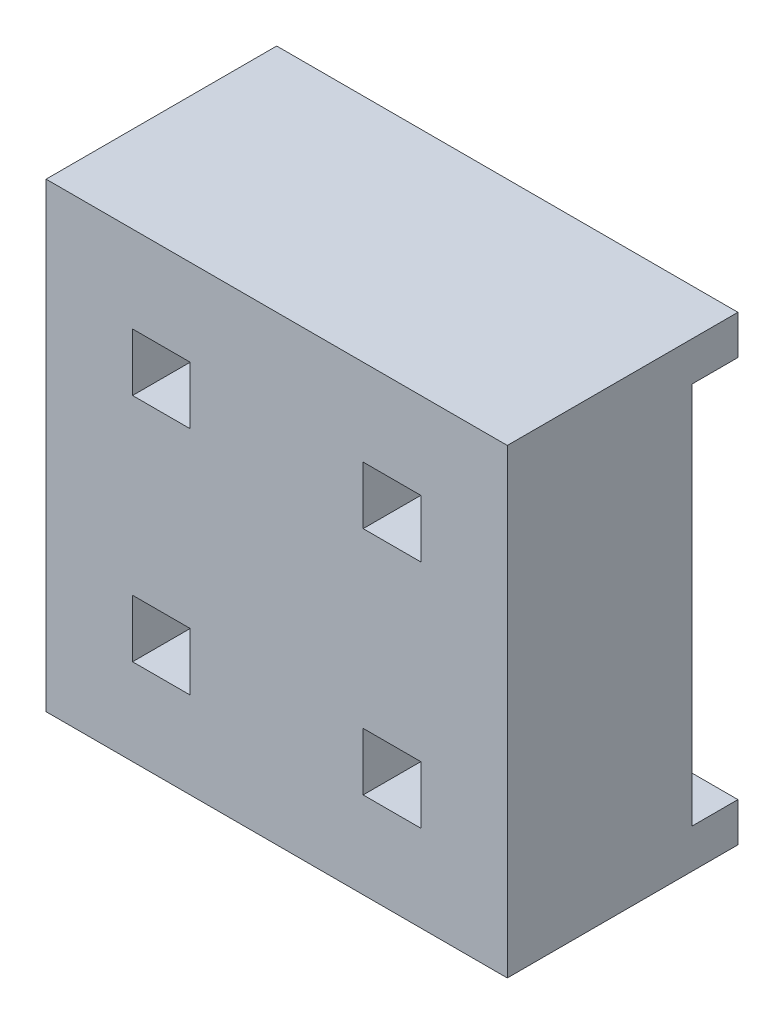
ISO-10303-21;
HEADER;
FILE_DESCRIPTION(('STEP AP214'),'2;1');
FILE_NAME('part.step','',(''),(''),'','','');
FILE_SCHEMA(('AUTOMOTIVE_DESIGN { 1 0 10303 214 1 1 1 1 }'));
ENDSEC;
DATA;
#1=APPLICATION_CONTEXT('core data for automotive mechanical design processes');
#2=APPLICATION_PROTOCOL_DEFINITION('international standard','automotive_design',2000,#1);
#3=PRODUCT_CONTEXT('',#1,'mechanical');
#4=PRODUCT('Part','Part','',(#3));
#5=PRODUCT_RELATED_PRODUCT_CATEGORY('part','',(#4));
#6=PRODUCT_DEFINITION_FORMATION('','',#4);
#7=PRODUCT_DEFINITION_CONTEXT('part definition',#1,'design');
#8=PRODUCT_DEFINITION('design','',#6,#7);
#9=PRODUCT_DEFINITION_SHAPE('','',#8);
#10=(LENGTH_UNIT() NAMED_UNIT(*) SI_UNIT(.MILLI.,.METRE.));
#11=(NAMED_UNIT(*) PLANE_ANGLE_UNIT() SI_UNIT($,.RADIAN.));
#12=(NAMED_UNIT(*) SI_UNIT($,.STERADIAN.) SOLID_ANGLE_UNIT());
#13=UNCERTAINTY_MEASURE_WITH_UNIT(LENGTH_MEASURE(1.E-05),#10,'distance_accuracy_value','');
#14=(GEOMETRIC_REPRESENTATION_CONTEXT(3) GLOBAL_UNCERTAINTY_ASSIGNED_CONTEXT((#13)) GLOBAL_UNIT_ASSIGNED_CONTEXT((#10,
#11,#12)) REPRESENTATION_CONTEXT('',''));
#15=CARTESIAN_POINT('',(0.,0.,0.));
#16=DIRECTION('',(0.,0.,1.));
#17=DIRECTION('',(1.,0.,0.));
#18=AXIS2_PLACEMENT_3D('',#15,#16,#17);
#19=CARTESIAN_POINT('',(0.000124023441458121,9.92187488009222E-05,1.25));
#20=DIRECTION('',(0.,-4.37113882867379E-08,1.));
#21=DIRECTION('',(0.,-1.,-4.37113882867379E-08));
#22=AXIS2_PLACEMENT_3D('',#19,#20,#21);
#23=PLANE('',#22);
#24=DIRECTION('',(0.,-0.999999999999999,-4.37113882735736E-08));
#25=VECTOR('',#24,1.);
#26=CARTESIAN_POINT('',(-2.53987597655854,-2.1081007812512,1.24999990784765));
#27=LINE('',#26,#25);
#28=CARTESIAN_POINT('',(-2.53987597655854,-2.1081007812512,1.24999990784765));
#29=VERTEX_POINT('',#28);
#30=CARTESIAN_POINT('',(-2.53987597655854,-2.5399007812512,1.24999988897307));
#31=VERTEX_POINT('',#30);
#32=EDGE_CURVE('E11',#29,#31,#27,.T.);
#33=ORIENTED_EDGE('',*,*,#32,.F.);
#34=DIRECTION('',(1.,0.,0.));
#35=VECTOR('',#34,1.);
#36=CARTESIAN_POINT('',(-2.53987597655854,-2.1081007812512,1.24999990784765));
#37=LINE('',#36,#35);
#38=CARTESIAN_POINT('',(2.54012402344146,-2.1081007812512,1.24999990784765));
#39=VERTEX_POINT('',#38);
#40=EDGE_CURVE('E323',#29,#39,#37,.T.);
#41=ORIENTED_EDGE('',*,*,#40,.T.);
#42=DIRECTION('',(0.,0.999999999999999,4.37113882735736E-08));
#43=VECTOR('',#42,1.);
#44=CARTESIAN_POINT('',(2.54012402344146,-2.5399007812512,1.24999988897307));
#45=LINE('',#44,#43);
#46=CARTESIAN_POINT('',(2.54012402344146,-2.5399007812512,1.24999988897307));
#47=VERTEX_POINT('',#46);
#48=EDGE_CURVE('E316',#47,#39,#45,.T.);
#49=ORIENTED_EDGE('',*,*,#48,.F.);
#50=DIRECTION('',(1.,0.,0.));
#51=VECTOR('',#50,1.);
#52=CARTESIAN_POINT('',(-2.53987597655854,-2.5399007812512,1.24999988897307));
#53=LINE('',#52,#51);
#54=EDGE_CURVE('E321',#31,#47,#53,.T.);
#55=ORIENTED_EDGE('',*,*,#54,.F.);
#56=EDGE_LOOP('',(#33,#41,#49,#55));
#57=FACE_BOUND('',#56,.T.);
#58=ADVANCED_FACE('F17',(#57),#23,.F.);
#59=CARTESIAN_POINT('',(-2.53987597655854,2.54009910772187,3.79000011102693));
#60=DIRECTION('',(1.,0.,0.));
#61=DIRECTION('',(0.,1.,4.37113882867379E-08));
#62=AXIS2_PLACEMENT_3D('',#59,#60,#61);
#63=PLANE('',#62);
#64=DIRECTION('',(0.,-0.999999999999999,-4.37113883231379E-08));
#65=VECTOR('',#64,1.);
#66=CARTESIAN_POINT('',(-2.53987597655854,2.10829919654342,1.75800009215235));
#67=LINE('',#66,#65);
#68=CARTESIAN_POINT('',(-2.53987597655854,2.10829919654342,1.75800009215235));
#69=VERTEX_POINT('',#68);
#70=CARTESIAN_POINT('',(-2.53987597655854,-2.10810080345658,1.75799990784765));
#71=VERTEX_POINT('',#70);
#72=EDGE_CURVE('E24',#69,#71,#67,.T.);
#73=ORIENTED_EDGE('',*,*,#72,.T.);
#74=DIRECTION('',(0.,4.37113888392268E-08,-0.999999999999999));
#75=VECTOR('',#74,1.);
#76=CARTESIAN_POINT('',(-2.53987597655854,-2.10810080345658,1.75799990784765));
#77=LINE('',#76,#75);
#78=EDGE_CURVE('E319',#71,#29,#77,.T.);
#79=ORIENTED_EDGE('',*,*,#78,.T.);
#80=ORIENTED_EDGE('',*,*,#32,.T.);
#81=DIRECTION('',(0.,4.3711388314712E-08,-0.999999999999999));
#82=VECTOR('',#81,1.);
#83=CARTESIAN_POINT('',(-2.53987597655854,-2.53990089227813,3.78999988897307));
#84=LINE('',#83,#82);
#85=CARTESIAN_POINT('',(-2.53987597655854,-2.53990089227813,3.78999988897307));
#86=VERTEX_POINT('',#85);
#87=EDGE_CURVE('E301',#86,#31,#84,.T.);
#88=ORIENTED_EDGE('',*,*,#87,.F.);
#89=DIRECTION('',(0.,-0.999999999999999,-4.37113884895503E-08));
#90=VECTOR('',#89,1.);
#91=CARTESIAN_POINT('',(-2.53987597655854,2.54009910772187,3.79000011102693));
#92=LINE('',#91,#90);
#93=CARTESIAN_POINT('',(-2.53987597655854,2.54009910772187,3.79000011102693));
#94=VERTEX_POINT('',#93);
#95=EDGE_CURVE('E289',#94,#86,#92,.T.);
#96=ORIENTED_EDGE('',*,*,#95,.F.);
#97=DIRECTION('',(0.,4.3711388314712E-08,-0.999999999999999));
#98=VECTOR('',#97,1.);
#99=CARTESIAN_POINT('',(-2.53987597655854,2.54009910772187,3.79000011102693));
#100=LINE('',#99,#98);
#101=CARTESIAN_POINT('',(-2.53987597655854,2.5400992187488,1.25000011102693));
#102=VERTEX_POINT('',#101);
#103=EDGE_CURVE('E276',#94,#102,#100,.T.);
#104=ORIENTED_EDGE('',*,*,#103,.T.);
#105=DIRECTION('',(0.,-0.999999999999999,-4.37113882735736E-08));
#106=VECTOR('',#105,1.);
#107=CARTESIAN_POINT('',(-2.53987597655854,2.5400992187488,1.25000011102693));
#108=LINE('',#107,#106);
#109=CARTESIAN_POINT('',(-2.53987597655854,2.1082992187488,1.25000009215235));
#110=VERTEX_POINT('',#109);
#111=EDGE_CURVE('E261',#102,#110,#108,.T.);
#112=ORIENTED_EDGE('',*,*,#111,.T.);
#113=DIRECTION('',(0.,-4.37113879650355E-08,0.999999999999999));
#114=VECTOR('',#113,1.);
#115=CARTESIAN_POINT('',(-2.53987597655854,2.1082992187488,1.25000009215235));
#116=LINE('',#115,#114);
#117=EDGE_CURVE('E247',#110,#69,#116,.T.);
#118=ORIENTED_EDGE('',*,*,#117,.T.);
#119=EDGE_LOOP('',(#73,#79,#80,#88,#96,#104,#112,#118));
#120=FACE_BOUND('',#119,.T.);
#121=ADVANCED_FACE('F416',(#120),#63,.F.);
#122=CARTESIAN_POINT('',(-2.53987597655854,-2.53990089227813,3.78999988897307));
#123=DIRECTION('',(0.,1.,4.37113882867379E-08));
#124=DIRECTION('',(-1.,0.,0.));
#125=AXIS2_PLACEMENT_3D('',#122,#123,#124);
#126=PLANE('',#125);
#127=ORIENTED_EDGE('',*,*,#54,.T.);
#128=DIRECTION('',(0.,4.3711388314712E-08,-0.999999999999999));
#129=VECTOR('',#128,1.);
#130=CARTESIAN_POINT('',(2.54012402344146,-2.53990089227813,3.78999988897307));
#131=LINE('',#130,#129);
#132=CARTESIAN_POINT('',(2.54012402344146,-2.53990089227813,3.78999988897307));
#133=VERTEX_POINT('',#132);
#134=EDGE_CURVE('E313',#133,#47,#131,.T.);
#135=ORIENTED_EDGE('',*,*,#134,.F.);
#136=DIRECTION('',(1.,0.,0.));
#137=VECTOR('',#136,1.);
#138=CARTESIAN_POINT('',(-2.53987597655854,-2.53990089227813,3.78999988897307));
#139=LINE('',#138,#137);
#140=EDGE_CURVE('E304',#86,#133,#139,.T.);
#141=ORIENTED_EDGE('',*,*,#140,.F.);
#142=ORIENTED_EDGE('',*,*,#87,.T.);
#143=EDGE_LOOP('',(#127,#135,#141,#142));
#144=FACE_BOUND('',#143,.T.);
#145=ADVANCED_FACE('F420',(#144),#126,.F.);
#146=CARTESIAN_POINT('',(2.54012402344146,-2.53990089227813,3.78999988897307));
#147=DIRECTION('',(-1.,0.,0.));
#148=DIRECTION('',(0.,-1.,-4.37113882867379E-08));
#149=AXIS2_PLACEMENT_3D('',#146,#147,#148);
#150=PLANE('',#149);
#151=ORIENTED_EDGE('',*,*,#48,.T.);
#152=DIRECTION('',(0.,4.37113888392268E-08,-0.999999999999999));
#153=VECTOR('',#152,1.);
#154=CARTESIAN_POINT('',(2.54012402344146,-2.10810080345658,1.75799990784765));
#155=LINE('',#154,#153);
#156=CARTESIAN_POINT('',(2.54012402344146,-2.10810080345658,1.75799990784765));
#157=VERTEX_POINT('',#156);
#158=EDGE_CURVE('E307',#157,#39,#155,.T.);
#159=ORIENTED_EDGE('',*,*,#158,.F.);
#160=DIRECTION('',(0.,-0.999999999999999,-4.37113883231379E-08));
#161=VECTOR('',#160,1.);
#162=CARTESIAN_POINT('',(2.54012402344146,2.10829919654342,1.75800009215235));
#163=LINE('',#162,#161);
#164=CARTESIAN_POINT('',(2.54012402344146,2.10829919654342,1.75800009215235));
#165=VERTEX_POINT('',#164);
#166=EDGE_CURVE('E292',#165,#157,#163,.T.);
#167=ORIENTED_EDGE('',*,*,#166,.F.);
#168=DIRECTION('',(0.,-4.37113879650355E-08,0.999999999999999));
#169=VECTOR('',#168,1.);
#170=CARTESIAN_POINT('',(2.54012402344146,2.1082992187488,1.25000009215235));
#171=LINE('',#170,#169);
#172=CARTESIAN_POINT('',(2.54012402344146,2.1082992187488,1.25000009215235));
#173=VERTEX_POINT('',#172);
#174=EDGE_CURVE('E278',#173,#165,#171,.T.);
#175=ORIENTED_EDGE('',*,*,#174,.F.);
#176=DIRECTION('',(0.,0.999999999999999,4.37113882735736E-08));
#177=VECTOR('',#176,1.);
#178=CARTESIAN_POINT('',(2.54012402344146,2.1082992187488,1.25000009215235));
#179=LINE('',#178,#177);
#180=CARTESIAN_POINT('',(2.54012402344146,2.5400992187488,1.25000011102693));
#181=VERTEX_POINT('',#180);
#182=EDGE_CURVE('E263',#173,#181,#179,.T.);
#183=ORIENTED_EDGE('',*,*,#182,.T.);
#184=DIRECTION('',(0.,4.3711388314712E-08,-0.999999999999999));
#185=VECTOR('',#184,1.);
#186=CARTESIAN_POINT('',(2.54012402344146,2.54009910772187,3.79000011102693));
#187=LINE('',#186,#185);
#188=CARTESIAN_POINT('',(2.54012402344146,2.54009910772187,3.79000011102693));
#189=VERTEX_POINT('',#188);
#190=EDGE_CURVE('E249',#189,#181,#187,.T.);
#191=ORIENTED_EDGE('',*,*,#190,.F.);
#192=DIRECTION('',(0.,0.999999999999999,4.37113881398737E-08));
#193=VECTOR('',#192,1.);
#194=CARTESIAN_POINT('',(2.54012402344146,-2.53990089227813,3.78999988897307));
#195=LINE('',#194,#193);
#196=EDGE_CURVE('E236',#133,#189,#195,.T.);
#197=ORIENTED_EDGE('',*,*,#196,.F.);
#198=ORIENTED_EDGE('',*,*,#134,.T.);
#199=EDGE_LOOP('',(#151,#159,#167,#175,#183,#191,#197,#198));
#200=FACE_BOUND('',#199,.T.);
#201=ADVANCED_FACE('F329',(#200),#150,.F.);
#202=CARTESIAN_POINT('',(0.952624023441458,1.58759910772187,3.79000006939183));
#203=DIRECTION('',(1.,0.,0.));
#204=DIRECTION('',(0.,1.,4.37113882867379E-08));
#205=AXIS2_PLACEMENT_3D('',#202,#203,#204);
#206=PLANE('',#205);
#207=DIRECTION('',(0.,-0.999999999999999,-4.3711388314712E-08));
#208=VECTOR('',#207,1.);
#209=CARTESIAN_POINT('',(0.952624023441458,1.58759919654342,1.75800006939183));
#210=LINE('',#209,#208);
#211=CARTESIAN_POINT('',(0.952624023441458,1.58759919654342,1.75800006939183));
#212=VERTEX_POINT('',#211);
#213=CARTESIAN_POINT('',(0.952624023441458,0.952599196543416,1.7580000416351));
#214=VERTEX_POINT('',#213);
#215=EDGE_CURVE('E310',#212,#214,#210,.T.);
#216=ORIENTED_EDGE('',*,*,#215,.F.);
#217=DIRECTION('',(0.,4.37113884021311E-08,-0.999999999999999));
#218=VECTOR('',#217,1.);
#219=CARTESIAN_POINT('',(0.952624023441458,1.58759910772187,3.79000006939183));
#220=LINE('',#219,#218);
#221=CARTESIAN_POINT('',(0.952624023441458,1.58759910772187,3.79000006939183));
#222=VERTEX_POINT('',#221);
#223=EDGE_CURVE('E295',#222,#212,#220,.T.);
#224=ORIENTED_EDGE('',*,*,#223,.F.);
#225=DIRECTION('',(0.,-0.999999999999999,-4.3711388314712E-08));
#226=VECTOR('',#225,1.);
#227=CARTESIAN_POINT('',(0.952624023441458,1.58759910772187,3.79000006939183));
#228=LINE('',#227,#226);
#229=CARTESIAN_POINT('',(0.952624023441458,0.952599107721875,3.7900000416351));
#230=VERTEX_POINT('',#229);
#231=EDGE_CURVE('E281',#222,#230,#228,.T.);
#232=ORIENTED_EDGE('',*,*,#231,.T.);
#233=DIRECTION('',(0.,4.37113882928572E-08,-0.999999999999999));
#234=VECTOR('',#233,1.);
#235=CARTESIAN_POINT('',(0.952624023441458,0.952599107721875,3.7900000416351));
#236=LINE('',#235,#234);
#237=EDGE_CURVE('E265',#230,#214,#236,.T.);
#238=ORIENTED_EDGE('',*,*,#237,.T.);
#239=EDGE_LOOP('',(#216,#224,#232,#238));
#240=FACE_BOUND('',#239,.T.);
#241=ADVANCED_FACE('F435',(#240),#206,.T.);
#242=CARTESIAN_POINT('',(1.58762402344146,1.58759910772187,3.79000006939183));
#243=DIRECTION('',(0.,-1.,-4.37113882867379E-08));
#244=DIRECTION('',(1.,0.,0.));
#245=AXIS2_PLACEMENT_3D('',#242,#243,#244);
#246=PLANE('',#245);
#247=DIRECTION('',(-1.,0.,0.));
#248=VECTOR('',#247,1.);
#249=CARTESIAN_POINT('',(1.58762402344146,1.58759919654342,1.75800006939183));
#250=LINE('',#249,#248);
#251=CARTESIAN_POINT('',(1.58762402344146,1.58759919654342,1.75800006939183));
#252=VERTEX_POINT('',#251);
#253=EDGE_CURVE('E298',#252,#212,#250,.T.);
#254=ORIENTED_EDGE('',*,*,#253,.F.);
#255=DIRECTION('',(0.,4.37113884021311E-08,-0.999999999999999));
#256=VECTOR('',#255,1.);
#257=CARTESIAN_POINT('',(1.58762402344146,1.58759910772187,3.79000006939183));
#258=LINE('',#257,#256);
#259=CARTESIAN_POINT('',(1.58762402344146,1.58759910772187,3.79000006939183));
#260=VERTEX_POINT('',#259);
#261=EDGE_CURVE('E283',#260,#252,#258,.T.);
#262=ORIENTED_EDGE('',*,*,#261,.F.);
#263=DIRECTION('',(-1.,0.,0.));
#264=VECTOR('',#263,1.);
#265=CARTESIAN_POINT('',(1.58762402344146,1.58759910772187,3.79000006939183));
#266=LINE('',#265,#264);
#267=EDGE_CURVE('E267',#260,#222,#266,.T.);
#268=ORIENTED_EDGE('',*,*,#267,.T.);
#269=ORIENTED_EDGE('',*,*,#223,.T.);
#270=EDGE_LOOP('',(#254,#262,#268,#269));
#271=FACE_BOUND('',#270,.T.);
#272=ADVANCED_FACE('F438',(#271),#246,.T.);
#273=CARTESIAN_POINT('',(1.58762402344146,0.952599107721875,3.7900000416351));
#274=DIRECTION('',(-1.,0.,0.));
#275=DIRECTION('',(0.,-1.,-4.37113882867379E-08));
#276=AXIS2_PLACEMENT_3D('',#273,#274,#275);
#277=PLANE('',#276);
#278=DIRECTION('',(0.,0.999999999999999,4.3711388314712E-08));
#279=VECTOR('',#278,1.);
#280=CARTESIAN_POINT('',(1.58762402344146,0.952599196543416,1.7580000416351));
#281=LINE('',#280,#279);
#282=CARTESIAN_POINT('',(1.58762402344146,0.952599196543416,1.7580000416351));
#283=VERTEX_POINT('',#282);
#284=EDGE_CURVE('E286',#283,#252,#281,.T.);
#285=ORIENTED_EDGE('',*,*,#284,.F.);
#286=DIRECTION('',(0.,4.37113882928572E-08,-0.999999999999999));
#287=VECTOR('',#286,1.);
#288=CARTESIAN_POINT('',(1.58762402344146,0.952599107721875,3.7900000416351));
#289=LINE('',#288,#287);
#290=CARTESIAN_POINT('',(1.58762402344146,0.952599107721875,3.7900000416351));
#291=VERTEX_POINT('',#290);
#292=EDGE_CURVE('E270',#291,#283,#289,.T.);
#293=ORIENTED_EDGE('',*,*,#292,.F.);
#294=DIRECTION('',(0.,0.999999999999999,4.3711388314712E-08));
#295=VECTOR('',#294,1.);
#296=CARTESIAN_POINT('',(1.58762402344146,0.952599107721875,3.7900000416351));
#297=LINE('',#296,#295);
#298=EDGE_CURVE('E252',#291,#260,#297,.T.);
#299=ORIENTED_EDGE('',*,*,#298,.T.);
#300=ORIENTED_EDGE('',*,*,#261,.T.);
#301=EDGE_LOOP('',(#285,#293,#299,#300));
#302=FACE_BOUND('',#301,.T.);
#303=ADVANCED_FACE('F442',(#302),#277,.T.);
#304=CARTESIAN_POINT('',(0.952624023441458,-0.952400892278125,3.7899999583649));
#305=DIRECTION('',(1.,0.,0.));
#306=DIRECTION('',(0.,1.,4.37113882867379E-08));
#307=AXIS2_PLACEMENT_3D('',#304,#305,#306);
#308=PLANE('',#307);
#309=DIRECTION('',(0.,-0.999999999999999,-4.3711388314712E-08));
#310=VECTOR('',#309,1.);
#311=CARTESIAN_POINT('',(0.952624023441458,-0.952400803456584,1.7579999583649));
#312=LINE('',#311,#310);
#313=CARTESIAN_POINT('',(0.952624023441458,-0.952400803456584,1.7579999583649));
#314=VERTEX_POINT('',#313);
#315=CARTESIAN_POINT('',(0.952624023441458,-1.58740080345658,1.75799993060817));
#316=VERTEX_POINT('',#315);
#317=EDGE_CURVE('E273',#314,#316,#312,.T.);
#318=ORIENTED_EDGE('',*,*,#317,.F.);
#319=DIRECTION('',(0.,4.37113882928572E-08,-0.999999999999999));
#320=VECTOR('',#319,1.);
#321=CARTESIAN_POINT('',(0.952624023441458,-0.952400892278125,3.7899999583649));
#322=LINE('',#321,#320);
#323=CARTESIAN_POINT('',(0.952624023441458,-0.952400892278125,3.7899999583649));
#324=VERTEX_POINT('',#323);
#325=EDGE_CURVE('E255',#324,#314,#322,.T.);
#326=ORIENTED_EDGE('',*,*,#325,.F.);
#327=DIRECTION('',(0.,-0.999999999999999,-4.3711388314712E-08));
#328=VECTOR('',#327,1.);
#329=CARTESIAN_POINT('',(0.952624023441458,-0.952400892278125,3.7899999583649));
#330=LINE('',#329,#328);
#331=CARTESIAN_POINT('',(0.952624023441458,-1.58740089227813,3.78999993060817));
#332=VERTEX_POINT('',#331);
#333=EDGE_CURVE('E239',#324,#332,#330,.T.);
#334=ORIENTED_EDGE('',*,*,#333,.T.);
#335=DIRECTION('',(0.,4.37113881835833E-08,-0.999999999999999));
#336=VECTOR('',#335,1.);
#337=CARTESIAN_POINT('',(0.952624023441458,-1.58740089227813,3.78999993060817));
#338=LINE('',#337,#336);
#339=EDGE_CURVE('E225',#332,#316,#338,.T.);
#340=ORIENTED_EDGE('',*,*,#339,.T.);
#341=EDGE_LOOP('',(#318,#326,#334,#340));
#342=FACE_BOUND('',#341,.T.);
#343=ADVANCED_FACE('F450',(#342),#308,.T.);
#344=CARTESIAN_POINT('',(1.58762402344146,-0.952400892278125,3.7899999583649));
#345=DIRECTION('',(0.,-1.,-4.37113882867379E-08));
#346=DIRECTION('',(1.,0.,0.));
#347=AXIS2_PLACEMENT_3D('',#344,#345,#346);
#348=PLANE('',#347);
#349=DIRECTION('',(-1.,0.,0.));
#350=VECTOR('',#349,1.);
#351=CARTESIAN_POINT('',(1.58762402344146,-0.952400803456584,1.7579999583649));
#352=LINE('',#351,#350);
#353=CARTESIAN_POINT('',(1.58762402344146,-0.952400803456584,1.7579999583649));
#354=VERTEX_POINT('',#353);
#355=EDGE_CURVE('E258',#354,#314,#352,.T.);
#356=ORIENTED_EDGE('',*,*,#355,.F.);
#357=DIRECTION('',(0.,4.37113882928572E-08,-0.999999999999999));
#358=VECTOR('',#357,1.);
#359=CARTESIAN_POINT('',(1.58762402344146,-0.952400892278125,3.7899999583649));
#360=LINE('',#359,#358);
#361=CARTESIAN_POINT('',(1.58762402344146,-0.952400892278125,3.7899999583649));
#362=VERTEX_POINT('',#361);
#363=EDGE_CURVE('E241',#362,#354,#360,.T.);
#364=ORIENTED_EDGE('',*,*,#363,.F.);
#365=DIRECTION('',(-1.,0.,0.));
#366=VECTOR('',#365,1.);
#367=CARTESIAN_POINT('',(1.58762402344146,-0.952400892278125,3.7899999583649));
#368=LINE('',#367,#366);
#369=EDGE_CURVE('E227',#362,#324,#368,.T.);
#370=ORIENTED_EDGE('',*,*,#369,.T.);
#371=ORIENTED_EDGE('',*,*,#325,.T.);
#372=EDGE_LOOP('',(#356,#364,#370,#371));
#373=FACE_BOUND('',#372,.T.);
#374=ADVANCED_FACE('F454',(#373),#348,.T.);
#375=CARTESIAN_POINT('',(1.58762402344146,-1.58740089227813,3.78999993060817));
#376=DIRECTION('',(-1.,0.,0.));
#377=DIRECTION('',(0.,-1.,-4.37113882867379E-08));
#378=AXIS2_PLACEMENT_3D('',#375,#376,#377);
#379=PLANE('',#378);
#380=DIRECTION('',(0.,0.999999999999999,4.3711388314712E-08));
#381=VECTOR('',#380,1.);
#382=CARTESIAN_POINT('',(1.58762402344146,-1.58740080345658,1.75799993060817));
#383=LINE('',#382,#381);
#384=CARTESIAN_POINT('',(1.58762402344146,-1.58740080345658,1.75799993060817));
#385=VERTEX_POINT('',#384);
#386=EDGE_CURVE('E244',#385,#354,#383,.T.);
#387=ORIENTED_EDGE('',*,*,#386,.F.);
#388=DIRECTION('',(0.,4.37113881835833E-08,-0.999999999999999));
#389=VECTOR('',#388,1.);
#390=CARTESIAN_POINT('',(1.58762402344146,-1.58740089227813,3.78999993060817));
#391=LINE('',#390,#389);
#392=CARTESIAN_POINT('',(1.58762402344146,-1.58740089227813,3.78999993060817));
#393=VERTEX_POINT('',#392);
#394=EDGE_CURVE('E230',#393,#385,#391,.T.);
#395=ORIENTED_EDGE('',*,*,#394,.F.);
#396=DIRECTION('',(0.,0.999999999999999,4.3711388314712E-08));
#397=VECTOR('',#396,1.);
#398=CARTESIAN_POINT('',(1.58762402344146,-1.58740089227813,3.78999993060817));
#399=LINE('',#398,#397);
#400=EDGE_CURVE('E216',#393,#362,#399,.T.);
#401=ORIENTED_EDGE('',*,*,#400,.T.);
#402=ORIENTED_EDGE('',*,*,#363,.T.);
#403=EDGE_LOOP('',(#387,#395,#401,#402));
#404=FACE_BOUND('',#403,.T.);
#405=ADVANCED_FACE('F464',(#404),#379,.T.);
#406=CARTESIAN_POINT('',(-1.58737597655854,1.58759910772187,3.79000006939183));
#407=DIRECTION('',(1.,0.,0.));
#408=DIRECTION('',(0.,1.,4.37113882867379E-08));
#409=AXIS2_PLACEMENT_3D('',#406,#407,#408);
#410=PLANE('',#409);
#411=DIRECTION('',(0.,-0.999999999999999,-4.3711388314712E-08));
#412=VECTOR('',#411,1.);
#413=CARTESIAN_POINT('',(-1.58737597655854,1.58759919654342,1.75800006939183));
#414=LINE('',#413,#412);
#415=CARTESIAN_POINT('',(-1.58737597655854,1.58759919654342,1.75800006939183));
#416=VERTEX_POINT('',#415);
#417=CARTESIAN_POINT('',(-1.58737597655854,0.952599196543416,1.7580000416351));
#418=VERTEX_POINT('',#417);
#419=EDGE_CURVE('E233',#416,#418,#414,.T.);
#420=ORIENTED_EDGE('',*,*,#419,.F.);
#421=DIRECTION('',(0.,4.37113884021311E-08,-0.999999999999999));
#422=VECTOR('',#421,1.);
#423=CARTESIAN_POINT('',(-1.58737597655854,1.58759910772187,3.79000006939183));
#424=LINE('',#423,#422);
#425=CARTESIAN_POINT('',(-1.58737597655854,1.58759910772187,3.79000006939183));
#426=VERTEX_POINT('',#425);
#427=EDGE_CURVE('E219',#426,#416,#424,.T.);
#428=ORIENTED_EDGE('',*,*,#427,.F.);
#429=DIRECTION('',(0.,-0.999999999999999,-4.3711388314712E-08));
#430=VECTOR('',#429,1.);
#431=CARTESIAN_POINT('',(-1.58737597655854,1.58759910772187,3.79000006939183));
#432=LINE('',#431,#430);
#433=CARTESIAN_POINT('',(-1.58737597655854,0.952599107721875,3.7900000416351));
#434=VERTEX_POINT('',#433);
#435=EDGE_CURVE('E201',#426,#434,#432,.T.);
#436=ORIENTED_EDGE('',*,*,#435,.T.);
#437=DIRECTION('',(0.,4.37113882928572E-08,-0.999999999999999));
#438=VECTOR('',#437,1.);
#439=CARTESIAN_POINT('',(-1.58737597655854,0.952599107721875,3.7900000416351));
#440=LINE('',#439,#438);
#441=EDGE_CURVE('E384',#434,#418,#440,.T.);
#442=ORIENTED_EDGE('',*,*,#441,.T.);
#443=EDGE_LOOP('',(#420,#428,#436,#442));
#444=FACE_BOUND('',#443,.T.);
#445=ADVANCED_FACE('F397',(#444),#410,.T.);
#446=CARTESIAN_POINT('',(-0.952375976558542,1.58759910772187,3.79000006939183));
#447=DIRECTION('',(0.,-1.,-4.37113882867379E-08));
#448=DIRECTION('',(1.,0.,0.));
#449=AXIS2_PLACEMENT_3D('',#446,#447,#448);
#450=PLANE('',#449);
#451=DIRECTION('',(-1.,0.,0.));
#452=VECTOR('',#451,1.);
#453=CARTESIAN_POINT('',(-0.952375976558542,1.58759919654342,1.75800006939183));
#454=LINE('',#453,#452);
#455=CARTESIAN_POINT('',(-0.952375976558542,1.58759919654342,1.75800006939183));
#456=VERTEX_POINT('',#455);
#457=EDGE_CURVE('E222',#456,#416,#454,.T.);
#458=ORIENTED_EDGE('',*,*,#457,.F.);
#459=DIRECTION('',(0.,4.37113884021311E-08,-0.999999999999999));
#460=VECTOR('',#459,1.);
#461=CARTESIAN_POINT('',(-0.952375976558542,1.58759910772187,3.79000006939183));
#462=LINE('',#461,#460);
#463=CARTESIAN_POINT('',(-0.952375976558542,1.58759910772187,3.79000006939183));
#464=VERTEX_POINT('',#463);
#465=EDGE_CURVE('E204',#464,#456,#462,.T.);
#466=ORIENTED_EDGE('',*,*,#465,.F.);
#467=DIRECTION('',(-1.,0.,0.));
#468=VECTOR('',#467,1.);
#469=CARTESIAN_POINT('',(-0.952375976558542,1.58759910772187,3.79000006939183));
#470=LINE('',#469,#468);
#471=EDGE_CURVE('E207',#464,#426,#470,.T.);
#472=ORIENTED_EDGE('',*,*,#471,.T.);
#473=ORIENTED_EDGE('',*,*,#427,.T.);
#474=EDGE_LOOP('',(#458,#466,#472,#473));
#475=FACE_BOUND('',#474,.T.);
#476=ADVANCED_FACE('F389',(#475),#450,.T.);
#477=CARTESIAN_POINT('',(-0.952375976558542,0.952599107721875,3.7900000416351));
#478=DIRECTION('',(-1.,0.,0.));
#479=DIRECTION('',(0.,-1.,-4.37113882867379E-08));
#480=AXIS2_PLACEMENT_3D('',#477,#478,#479);
#481=PLANE('',#480);
#482=DIRECTION('',(0.,0.999999999999999,4.3711388314712E-08));
#483=VECTOR('',#482,1.);
#484=CARTESIAN_POINT('',(-0.952375976558542,0.952599196543416,1.7580000416351));
#485=LINE('',#484,#483);
#486=CARTESIAN_POINT('',(-0.952375976558542,0.952599196543416,1.7580000416351));
#487=VERTEX_POINT('',#486);
#488=EDGE_CURVE('E213',#487,#456,#485,.T.);
#489=ORIENTED_EDGE('',*,*,#488,.F.);
#490=DIRECTION('',(0.,4.37113882928572E-08,-0.999999999999999));
#491=VECTOR('',#490,1.);
#492=CARTESIAN_POINT('',(-0.952375976558542,0.952599107721875,3.7900000416351));
#493=LINE('',#492,#491);
#494=CARTESIAN_POINT('',(-0.952375976558542,0.952599107721875,3.7900000416351));
#495=VERTEX_POINT('',#494);
#496=EDGE_CURVE('E202',#495,#487,#493,.T.);
#497=ORIENTED_EDGE('',*,*,#496,.F.);
#498=DIRECTION('',(0.,0.999999999999999,4.3711388314712E-08));
#499=VECTOR('',#498,1.);
#500=CARTESIAN_POINT('',(-0.952375976558542,0.952599107721875,3.7900000416351));
#501=LINE('',#500,#499);
#502=EDGE_CURVE('E378',#495,#464,#501,.T.);
#503=ORIENTED_EDGE('',*,*,#502,.T.);
#504=ORIENTED_EDGE('',*,*,#465,.T.);
#505=EDGE_LOOP('',(#489,#497,#503,#504));
#506=FACE_BOUND('',#505,.T.);
#507=ADVANCED_FACE('F403',(#506),#481,.T.);
#508=CARTESIAN_POINT('',(-1.58737597655854,-0.952400892278125,3.7899999583649));
#509=DIRECTION('',(1.,0.,0.));
#510=DIRECTION('',(0.,1.,4.37113882867379E-08));
#511=AXIS2_PLACEMENT_3D('',#508,#509,#510);
#512=PLANE('',#511);
#513=DIRECTION('',(0.,-0.999999999999999,-4.3711388314712E-08));
#514=VECTOR('',#513,1.);
#515=CARTESIAN_POINT('',(-1.58737597655854,-0.952400803456584,1.7579999583649));
#516=LINE('',#515,#514);
#517=CARTESIAN_POINT('',(-1.58737597655854,-0.952400803456584,1.7579999583649));
#518=VERTEX_POINT('',#517);
#519=CARTESIAN_POINT('',(-1.58737597655854,-1.58740080345658,1.75799993060817));
#520=VERTEX_POINT('',#519);
#521=EDGE_CURVE('E177',#518,#520,#516,.T.);
#522=ORIENTED_EDGE('',*,*,#521,.F.);
#523=DIRECTION('',(0.,4.37113882928572E-08,-0.999999999999999));
#524=VECTOR('',#523,1.);
#525=CARTESIAN_POINT('',(-1.58737597655854,-0.952400892278125,3.7899999583649));
#526=LINE('',#525,#524);
#527=CARTESIAN_POINT('',(-1.58737597655854,-0.952400892278125,3.7899999583649));
#528=VERTEX_POINT('',#527);
#529=EDGE_CURVE('E381',#528,#518,#526,.T.);
#530=ORIENTED_EDGE('',*,*,#529,.F.);
#531=DIRECTION('',(0.,-0.999999999999999,-4.3711388314712E-08));
#532=VECTOR('',#531,1.);
#533=CARTESIAN_POINT('',(-1.58737597655854,-0.952400892278125,3.7899999583649));
#534=LINE('',#533,#532);
#535=CARTESIAN_POINT('',(-1.58737597655854,-1.58740089227813,3.78999993060817));
#536=VERTEX_POINT('',#535);
#537=EDGE_CURVE('E180',#528,#536,#534,.T.);
#538=ORIENTED_EDGE('',*,*,#537,.T.);
#539=DIRECTION('',(0.,4.37113881835833E-08,-0.999999999999999));
#540=VECTOR('',#539,1.);
#541=CARTESIAN_POINT('',(-1.58737597655854,-1.58740089227813,3.78999993060817));
#542=LINE('',#541,#540);
#543=EDGE_CURVE('E173',#536,#520,#542,.T.);
#544=ORIENTED_EDGE('',*,*,#543,.T.);
#545=EDGE_LOOP('',(#522,#530,#538,#544));
#546=FACE_BOUND('',#545,.T.);
#547=ADVANCED_FACE('F175',(#546),#512,.T.);
#548=CARTESIAN_POINT('',(-0.952375976558542,-0.952400892278125,3.7899999583649));
#549=DIRECTION('',(0.,-1.,-4.37113882867379E-08));
#550=DIRECTION('',(1.,0.,0.));
#551=AXIS2_PLACEMENT_3D('',#548,#549,#550);
#552=PLANE('',#551);
#553=DIRECTION('',(-1.,0.,0.));
#554=VECTOR('',#553,1.);
#555=CARTESIAN_POINT('',(-0.952375976558542,-0.952400803456584,1.7579999583649));
#556=LINE('',#555,#554);
#557=CARTESIAN_POINT('',(-0.952375976558542,-0.952400803456584,1.7579999583649));
#558=VERTEX_POINT('',#557);
#559=EDGE_CURVE('E200',#558,#518,#556,.T.);
#560=ORIENTED_EDGE('',*,*,#559,.F.);
#561=DIRECTION('',(0.,4.37113882928572E-08,-0.999999999999999));
#562=VECTOR('',#561,1.);
#563=CARTESIAN_POINT('',(-0.952375976558542,-0.952400892278125,3.7899999583649));
#564=LINE('',#563,#562);
#565=CARTESIAN_POINT('',(-0.952375976558542,-0.952400892278125,3.7899999583649));
#566=VERTEX_POINT('',#565);
#567=EDGE_CURVE('E373',#566,#558,#564,.T.);
#568=ORIENTED_EDGE('',*,*,#567,.F.);
#569=DIRECTION('',(-1.,0.,0.));
#570=VECTOR('',#569,1.);
#571=CARTESIAN_POINT('',(-0.952375976558542,-0.952400892278125,3.7899999583649));
#572=LINE('',#571,#570);
#573=EDGE_CURVE('E184',#566,#528,#572,.T.);
#574=ORIENTED_EDGE('',*,*,#573,.T.);
#575=ORIENTED_EDGE('',*,*,#529,.T.);
#576=EDGE_LOOP('',(#560,#568,#574,#575));
#577=FACE_BOUND('',#576,.T.);
#578=ADVANCED_FACE('F411',(#577),#552,.T.);
#579=CARTESIAN_POINT('',(-0.952375976558542,-1.58740089227813,3.78999993060817));
#580=DIRECTION('',(-1.,0.,0.));
#581=DIRECTION('',(0.,-1.,-4.37113882867379E-08));
#582=AXIS2_PLACEMENT_3D('',#579,#580,#581);
#583=PLANE('',#582);
#584=DIRECTION('',(0.,0.999999999999999,4.3711388314712E-08));
#585=VECTOR('',#584,1.);
#586=CARTESIAN_POINT('',(-0.952375976558542,-1.58740080345658,1.75799993060817));
#587=LINE('',#586,#585);
#588=CARTESIAN_POINT('',(-0.952375976558542,-1.58740080345658,1.75799993060817));
#589=VERTEX_POINT('',#588);
#590=EDGE_CURVE('E376',#589,#558,#587,.T.);
#591=ORIENTED_EDGE('',*,*,#590,.F.);
#592=DIRECTION('',(0.,4.37113881835833E-08,-0.999999999999999));
#593=VECTOR('',#592,1.);
#594=CARTESIAN_POINT('',(-0.952375976558542,-1.58740089227813,3.78999993060817));
#595=LINE('',#594,#593);
#596=CARTESIAN_POINT('',(-0.952375976558542,-1.58740089227813,3.78999993060817));
#597=VERTEX_POINT('',#596);
#598=EDGE_CURVE('E191',#597,#589,#595,.T.);
#599=ORIENTED_EDGE('',*,*,#598,.F.);
#600=DIRECTION('',(0.,0.999999999999999,4.3711388314712E-08));
#601=VECTOR('',#600,1.);
#602=CARTESIAN_POINT('',(-0.952375976558542,-1.58740089227813,3.78999993060817));
#603=LINE('',#602,#601);
#604=EDGE_CURVE('E361',#597,#566,#603,.T.);
#605=ORIENTED_EDGE('',*,*,#604,.T.);
#606=ORIENTED_EDGE('',*,*,#567,.T.);
#607=EDGE_LOOP('',(#591,#599,#605,#606));
#608=FACE_BOUND('',#607,.T.);
#609=ADVANCED_FACE('F470',(#608),#583,.T.);
#610=CARTESIAN_POINT('',(0.952624023441458,0.952599107721875,3.7900000416351));
#611=DIRECTION('',(0.,1.,4.37113882867379E-08));
#612=DIRECTION('',(-1.,0.,0.));
#613=AXIS2_PLACEMENT_3D('',#610,#611,#612);
#614=PLANE('',#613);
#615=DIRECTION('',(1.,0.,0.));
#616=VECTOR('',#615,1.);
#617=CARTESIAN_POINT('',(0.952624023441458,0.952599196543416,1.7580000416351));
#618=LINE('',#617,#616);
#619=EDGE_CURVE('E369',#214,#283,#618,.T.);
#620=ORIENTED_EDGE('',*,*,#619,.F.);
#621=ORIENTED_EDGE('',*,*,#237,.F.);
#622=DIRECTION('',(1.,0.,0.));
#623=VECTOR('',#622,1.);
#624=CARTESIAN_POINT('',(0.952624023441458,0.952599107721875,3.7900000416351));
#625=LINE('',#624,#623);
#626=EDGE_CURVE('E194',#230,#291,#625,.T.);
#627=ORIENTED_EDGE('',*,*,#626,.T.);
#628=ORIENTED_EDGE('',*,*,#292,.T.);
#629=EDGE_LOOP('',(#620,#621,#627,#628));
#630=FACE_BOUND('',#629,.T.);
#631=ADVANCED_FACE('F466',(#630),#614,.T.);
#632=CARTESIAN_POINT('',(0.952624023441458,-1.58740089227813,3.78999993060817));
#633=DIRECTION('',(0.,1.,4.37113882867379E-08));
#634=DIRECTION('',(-1.,0.,0.));
#635=AXIS2_PLACEMENT_3D('',#632,#633,#634);
#636=PLANE('',#635);
#637=DIRECTION('',(1.,0.,0.));
#638=VECTOR('',#637,1.);
#639=CARTESIAN_POINT('',(0.952624023441458,-1.58740080345658,1.75799993060817));
#640=LINE('',#639,#638);
#641=EDGE_CURVE('E185',#316,#385,#640,.T.);
#642=ORIENTED_EDGE('',*,*,#641,.F.);
#643=ORIENTED_EDGE('',*,*,#339,.F.);
#644=DIRECTION('',(1.,0.,0.));
#645=VECTOR('',#644,1.);
#646=CARTESIAN_POINT('',(0.952624023441458,-1.58740089227813,3.78999993060817));
#647=LINE('',#646,#645);
#648=EDGE_CURVE('E195',#332,#393,#647,.T.);
#649=ORIENTED_EDGE('',*,*,#648,.T.);
#650=ORIENTED_EDGE('',*,*,#394,.T.);
#651=EDGE_LOOP('',(#642,#643,#649,#650));
#652=FACE_BOUND('',#651,.T.);
#653=ADVANCED_FACE('F469',(#652),#636,.T.);
#654=CARTESIAN_POINT('',(-1.58737597655854,0.952599107721875,3.7900000416351));
#655=DIRECTION('',(0.,1.,4.37113882867379E-08));
#656=DIRECTION('',(-1.,0.,0.));
#657=AXIS2_PLACEMENT_3D('',#654,#655,#656);
#658=PLANE('',#657);
#659=DIRECTION('',(1.,0.,0.));
#660=VECTOR('',#659,1.);
#661=CARTESIAN_POINT('',(-1.58737597655854,0.952599196543416,1.7580000416351));
#662=LINE('',#661,#660);
#663=EDGE_CURVE('E358',#418,#487,#662,.T.);
#664=ORIENTED_EDGE('',*,*,#663,.F.);
#665=ORIENTED_EDGE('',*,*,#441,.F.);
#666=DIRECTION('',(1.,0.,0.));
#667=VECTOR('',#666,1.);
#668=CARTESIAN_POINT('',(-1.58737597655854,0.952599107721875,3.7900000416351));
#669=LINE('',#668,#667);
#670=EDGE_CURVE('E348',#434,#495,#669,.T.);
#671=ORIENTED_EDGE('',*,*,#670,.T.);
#672=ORIENTED_EDGE('',*,*,#496,.T.);
#673=EDGE_LOOP('',(#664,#665,#671,#672));
#674=FACE_BOUND('',#673,.T.);
#675=ADVANCED_FACE('F400',(#674),#658,.T.);
#676=CARTESIAN_POINT('',(-1.58737597655854,-1.58740089227813,3.78999993060817));
#677=DIRECTION('',(0.,1.,4.37113882867379E-08));
#678=DIRECTION('',(-1.,0.,0.));
#679=AXIS2_PLACEMENT_3D('',#676,#677,#678);
#680=PLANE('',#679);
#681=DIRECTION('',(1.,0.,0.));
#682=VECTOR('',#681,1.);
#683=CARTESIAN_POINT('',(-1.58737597655854,-1.58740080345658,1.75799993060817));
#684=LINE('',#683,#682);
#685=EDGE_CURVE('E189',#520,#589,#684,.T.);
#686=ORIENTED_EDGE('',*,*,#685,.F.);
#687=ORIENTED_EDGE('',*,*,#543,.F.);
#688=DIRECTION('',(1.,0.,0.));
#689=VECTOR('',#688,1.);
#690=CARTESIAN_POINT('',(-1.58737597655854,-1.58740089227813,3.78999993060817));
#691=LINE('',#690,#689);
#692=EDGE_CURVE('E346',#536,#597,#691,.T.);
#693=ORIENTED_EDGE('',*,*,#692,.T.);
#694=ORIENTED_EDGE('',*,*,#598,.T.);
#695=EDGE_LOOP('',(#686,#687,#693,#694));
#696=FACE_BOUND('',#695,.T.);
#697=ADVANCED_FACE('F190',(#696),#680,.T.);
#698=CARTESIAN_POINT('',(2.54012402344146,2.54009910772187,3.79000011102693));
#699=DIRECTION('',(0.,-1.,-4.37113882867379E-08));
#700=DIRECTION('',(1.,0.,0.));
#701=AXIS2_PLACEMENT_3D('',#698,#699,#700);
#702=PLANE('',#701);
#703=DIRECTION('',(-1.,0.,0.));
#704=VECTOR('',#703,1.);
#705=CARTESIAN_POINT('',(2.54012402344146,2.5400992187488,1.25000011102693));
#706=LINE('',#705,#704);
#707=EDGE_CURVE('E351',#181,#102,#706,.T.);
#708=ORIENTED_EDGE('',*,*,#707,.T.);
#709=ORIENTED_EDGE('',*,*,#103,.F.);
#710=DIRECTION('',(-1.,0.,0.));
#711=VECTOR('',#710,1.);
#712=CARTESIAN_POINT('',(2.54012402344146,2.54009910772187,3.79000011102693));
#713=LINE('',#712,#711);
#714=EDGE_CURVE('E339',#189,#94,#713,.T.);
#715=ORIENTED_EDGE('',*,*,#714,.F.);
#716=ORIENTED_EDGE('',*,*,#190,.T.);
#717=EDGE_LOOP('',(#708,#709,#715,#716));
#718=FACE_BOUND('',#717,.T.);
#719=ADVANCED_FACE('F446',(#718),#702,.F.);
#720=CARTESIAN_POINT('',(0.000124023441458121,9.91077218746739E-05,3.79));
#721=DIRECTION('',(0.,-4.37113882867379E-08,1.));
#722=DIRECTION('',(0.,-1.,-4.37113882867379E-08));
#723=AXIS2_PLACEMENT_3D('',#720,#721,#722);
#724=PLANE('',#723);
#725=ORIENTED_EDGE('',*,*,#95,.T.);
#726=ORIENTED_EDGE('',*,*,#140,.T.);
#727=ORIENTED_EDGE('',*,*,#196,.T.);
#728=ORIENTED_EDGE('',*,*,#714,.T.);
#729=EDGE_LOOP('',(#725,#726,#727,#728));
#730=FACE_BOUND('',#729,.T.);
#731=ORIENTED_EDGE('',*,*,#435,.F.);
#732=ORIENTED_EDGE('',*,*,#471,.F.);
#733=ORIENTED_EDGE('',*,*,#502,.F.);
#734=ORIENTED_EDGE('',*,*,#670,.F.);
#735=EDGE_LOOP('',(#731,#732,#733,#734));
#736=FACE_BOUND('',#735,.T.);
#737=ORIENTED_EDGE('',*,*,#333,.F.);
#738=ORIENTED_EDGE('',*,*,#369,.F.);
#739=ORIENTED_EDGE('',*,*,#400,.F.);
#740=ORIENTED_EDGE('',*,*,#648,.F.);
#741=EDGE_LOOP('',(#737,#738,#739,#740));
#742=FACE_BOUND('',#741,.T.);
#743=ORIENTED_EDGE('',*,*,#231,.F.);
#744=ORIENTED_EDGE('',*,*,#267,.F.);
#745=ORIENTED_EDGE('',*,*,#298,.F.);
#746=ORIENTED_EDGE('',*,*,#626,.F.);
#747=EDGE_LOOP('',(#743,#744,#745,#746));
#748=FACE_BOUND('',#747,.T.);
#749=ORIENTED_EDGE('',*,*,#537,.F.);
#750=ORIENTED_EDGE('',*,*,#573,.F.);
#751=ORIENTED_EDGE('',*,*,#604,.F.);
#752=ORIENTED_EDGE('',*,*,#692,.F.);
#753=EDGE_LOOP('',(#749,#750,#751,#752));
#754=FACE_BOUND('',#753,.T.);
#755=ADVANCED_FACE('F393',(#730,#736,#742,#748,#754),#724,.T.);
#756=CARTESIAN_POINT('',(0.000124023441458121,9.92187488009222E-05,1.25));
#757=DIRECTION('',(0.,-4.37113882867379E-08,1.));
#758=DIRECTION('',(0.,-1.,-4.37113882867379E-08));
#759=AXIS2_PLACEMENT_3D('',#756,#757,#758);
#760=PLANE('',#759);
#761=ORIENTED_EDGE('',*,*,#182,.F.);
#762=DIRECTION('',(1.,0.,0.));
#763=VECTOR('',#762,1.);
#764=CARTESIAN_POINT('',(-2.53987597655854,2.1082992187488,1.25000009215235));
#765=LINE('',#764,#763);
#766=EDGE_CURVE('E335',#110,#173,#765,.T.);
#767=ORIENTED_EDGE('',*,*,#766,.F.);
#768=ORIENTED_EDGE('',*,*,#111,.F.);
#769=ORIENTED_EDGE('',*,*,#707,.F.);
#770=EDGE_LOOP('',(#761,#767,#768,#769));
#771=FACE_BOUND('',#770,.T.);
#772=ADVANCED_FACE('F429',(#771),#760,.F.);
#773=CARTESIAN_POINT('',(-2.53987597655854,2.10829919654342,1.75800009215235));
#774=DIRECTION('',(0.,-4.37113882867379E-08,1.));
#775=DIRECTION('',(0.,-1.,-4.37113882867379E-08));
#776=AXIS2_PLACEMENT_3D('',#773,#774,#775);
#777=PLANE('',#776);
#778=ORIENTED_EDGE('',*,*,#166,.T.);
#779=DIRECTION('',(1.,0.,0.));
#780=VECTOR('',#779,1.);
#781=CARTESIAN_POINT('',(-2.53987597655854,-2.10810080345658,1.75799990784765));
#782=LINE('',#781,#780);
#783=EDGE_CURVE('E333',#71,#157,#782,.T.);
#784=ORIENTED_EDGE('',*,*,#783,.F.);
#785=ORIENTED_EDGE('',*,*,#72,.F.);
#786=DIRECTION('',(1.,0.,0.));
#787=VECTOR('',#786,1.);
#788=CARTESIAN_POINT('',(-2.53987597655854,2.10829919654342,1.75800009215235));
#789=LINE('',#788,#787);
#790=EDGE_CURVE('E336',#69,#165,#789,.T.);
#791=ORIENTED_EDGE('',*,*,#790,.T.);
#792=EDGE_LOOP('',(#778,#784,#785,#791));
#793=FACE_BOUND('',#792,.T.);
#794=ORIENTED_EDGE('',*,*,#317,.T.);
#795=ORIENTED_EDGE('',*,*,#641,.T.);
#796=ORIENTED_EDGE('',*,*,#386,.T.);
#797=ORIENTED_EDGE('',*,*,#355,.T.);
#798=EDGE_LOOP('',(#794,#795,#796,#797));
#799=FACE_BOUND('',#798,.T.);
#800=ORIENTED_EDGE('',*,*,#419,.T.);
#801=ORIENTED_EDGE('',*,*,#663,.T.);
#802=ORIENTED_EDGE('',*,*,#488,.T.);
#803=ORIENTED_EDGE('',*,*,#457,.T.);
#804=EDGE_LOOP('',(#800,#801,#802,#803));
#805=FACE_BOUND('',#804,.T.);
#806=ORIENTED_EDGE('',*,*,#521,.T.);
#807=ORIENTED_EDGE('',*,*,#685,.T.);
#808=ORIENTED_EDGE('',*,*,#590,.T.);
#809=ORIENTED_EDGE('',*,*,#559,.T.);
#810=EDGE_LOOP('',(#806,#807,#808,#809));
#811=FACE_BOUND('',#810,.T.);
#812=ORIENTED_EDGE('',*,*,#215,.T.);
#813=ORIENTED_EDGE('',*,*,#619,.T.);
#814=ORIENTED_EDGE('',*,*,#284,.T.);
#815=ORIENTED_EDGE('',*,*,#253,.T.);
#816=EDGE_LOOP('',(#812,#813,#814,#815));
#817=FACE_BOUND('',#816,.T.);
#818=ADVANCED_FACE('F198',(#793,#799,#805,#811,#817),#777,.F.);
#819=CARTESIAN_POINT('',(-2.53987597655854,-2.10810080345658,1.75799990784765));
#820=DIRECTION('',(0.,-1.,-4.37113891404404E-08));
#821=DIRECTION('',(0.,4.37113891404404E-08,-1.));
#822=AXIS2_PLACEMENT_3D('',#819,#820,#821);
#823=PLANE('',#822);
#824=ORIENTED_EDGE('',*,*,#158,.T.);
#825=ORIENTED_EDGE('',*,*,#40,.F.);
#826=ORIENTED_EDGE('',*,*,#78,.F.);
#827=ORIENTED_EDGE('',*,*,#783,.T.);
#828=EDGE_LOOP('',(#824,#825,#826,#827));
#829=FACE_BOUND('',#828,.T.);
#830=ADVANCED_FACE('F332',(#829),#823,.F.);
#831=CARTESIAN_POINT('',(-2.53987597655854,2.1082992187488,1.25000009215235));
#832=DIRECTION('',(0.,1.,4.37113882867379E-08));
#833=DIRECTION('',(-1.,0.,0.));
#834=AXIS2_PLACEMENT_3D('',#831,#832,#833);
#835=PLANE('',#834);
#836=ORIENTED_EDGE('',*,*,#174,.T.);
#837=ORIENTED_EDGE('',*,*,#790,.F.);
#838=ORIENTED_EDGE('',*,*,#117,.F.);
#839=ORIENTED_EDGE('',*,*,#766,.T.);
#840=EDGE_LOOP('',(#836,#837,#838,#839));
#841=FACE_BOUND('',#840,.T.);
#842=ADVANCED_FACE('F432',(#841),#835,.F.);
#843=CLOSED_SHELL('',(#58,#121,#145,#201,#241,#272,#303,#343,#374,#405,#445,#476,#507,#547,#578,
#609,#631,#653,#675,#697,#719,#755,#772,#818,#830,#842));
#844=MANIFOLD_SOLID_BREP('B1',#843);
#845=ADVANCED_BREP_SHAPE_REPRESENTATION('',(#18,#844),#14);
#846=SHAPE_DEFINITION_REPRESENTATION(#9,#845);
ENDSEC;
END-ISO-10303-21;
